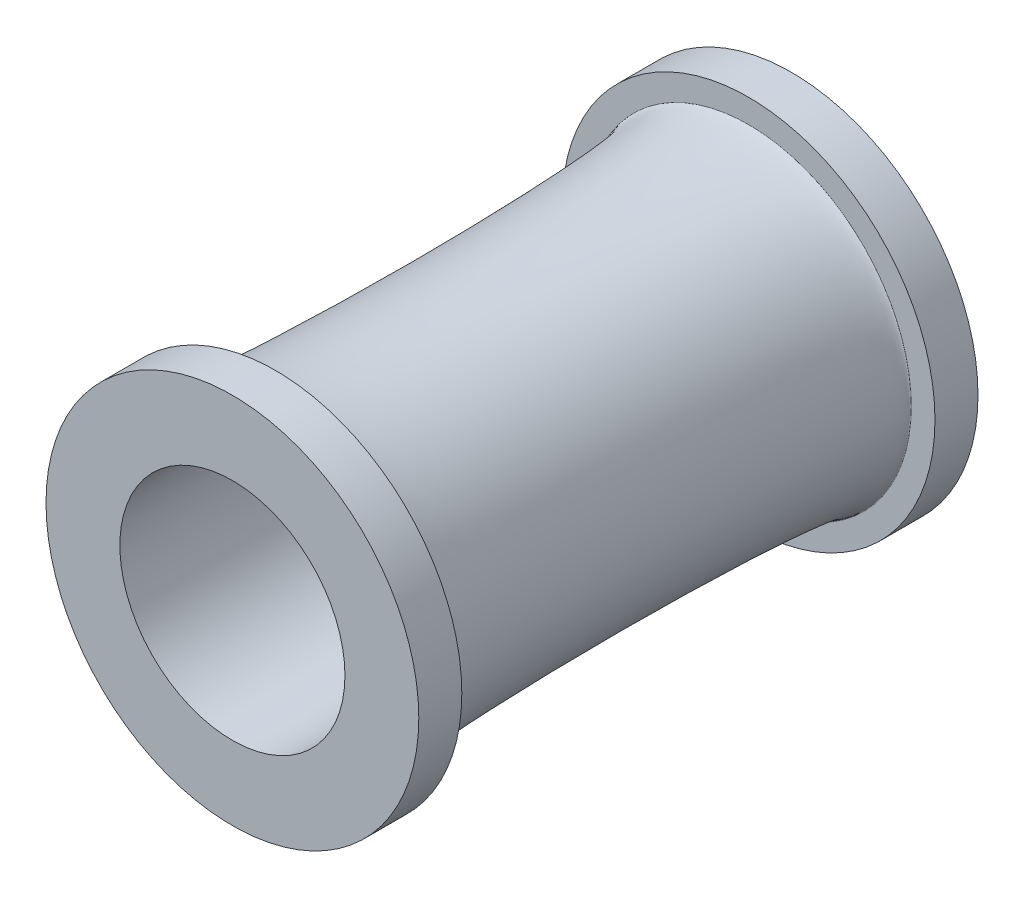
ISO-10303-21;
HEADER;
FILE_DESCRIPTION(('STEP AP214'),'2;1');
FILE_NAME('part.step','',(''),(''),'','','');
FILE_SCHEMA(('AUTOMOTIVE_DESIGN { 1 0 10303 214 1 1 1 1 }'));
ENDSEC;
DATA;
#1=APPLICATION_CONTEXT('core data for automotive mechanical design processes');
#2=APPLICATION_PROTOCOL_DEFINITION('international standard','automotive_design',2000,#1);
#3=PRODUCT_CONTEXT('',#1,'mechanical');
#4=PRODUCT('Part','Part','',(#3));
#5=PRODUCT_RELATED_PRODUCT_CATEGORY('part','',(#4));
#6=PRODUCT_DEFINITION_FORMATION('','',#4);
#7=PRODUCT_DEFINITION_CONTEXT('part definition',#1,'design');
#8=PRODUCT_DEFINITION('design','',#6,#7);
#9=PRODUCT_DEFINITION_SHAPE('','',#8);
#10=(LENGTH_UNIT() NAMED_UNIT(*) SI_UNIT(.MILLI.,.METRE.));
#11=(NAMED_UNIT(*) PLANE_ANGLE_UNIT() SI_UNIT($,.RADIAN.));
#12=(NAMED_UNIT(*) SI_UNIT($,.STERADIAN.) SOLID_ANGLE_UNIT());
#13=UNCERTAINTY_MEASURE_WITH_UNIT(LENGTH_MEASURE(1.E-05),#10,'distance_accuracy_value','');
#14=(GEOMETRIC_REPRESENTATION_CONTEXT(3) GLOBAL_UNCERTAINTY_ASSIGNED_CONTEXT((#13)) GLOBAL_UNIT_ASSIGNED_CONTEXT((#10,
#11,#12)) REPRESENTATION_CONTEXT('',''));
#15=CARTESIAN_POINT('',(0.,0.,0.));
#16=DIRECTION('',(0.,0.,1.));
#17=DIRECTION('',(1.,0.,0.));
#18=AXIS2_PLACEMENT_3D('',#15,#16,#17);
#19=CARTESIAN_POINT('',(0.,0.,41.91));
#20=DIRECTION('',(0.,0.,1.));
#21=DIRECTION('',(1.,0.,0.));
#22=AXIS2_PLACEMENT_3D('',#19,#20,#21);
#23=PLANE('',#22);
#24=CARTESIAN_POINT('',(0.,0.,41.91));
#25=DIRECTION('',(0.,0.,1.));
#26=DIRECTION('',(1.,0.,0.));
#27=AXIS2_PLACEMENT_3D('',#24,#25,#26);
#28=CIRCLE('',#27,14.4145);
#29=CARTESIAN_POINT('',(14.4145,0.,41.91));
#30=VERTEX_POINT('',#29);
#31=EDGE_CURVE('E45',#30,#30,#28,.T.);
#32=ORIENTED_EDGE('',*,*,#31,.T.);
#33=EDGE_LOOP('',(#32));
#34=FACE_BOUND('',#33,.T.);
#35=CARTESIAN_POINT('',(0.,0.,41.91));
#36=DIRECTION('',(0.,0.,1.));
#37=DIRECTION('',(1.,0.,0.));
#38=AXIS2_PLACEMENT_3D('',#35,#36,#37);
#39=CIRCLE('',#38,16.51);
#40=CARTESIAN_POINT('',(16.51,0.,41.91));
#41=VERTEX_POINT('',#40);
#42=EDGE_CURVE('E53',#41,#41,#39,.T.);
#43=ORIENTED_EDGE('',*,*,#42,.F.);
#44=EDGE_LOOP('',(#43));
#45=FACE_BOUND('',#44,.T.);
#46=ADVANCED_FACE('F33',(#34,#45),#23,.F.);
#47=CARTESIAN_POINT('',(-14.4145,0.,20.955));
#48=DIRECTION('',(0.,1.,0.));
#49=DIRECTION('',(0.,0.,1.));
#50=AXIS2_PLACEMENT_3D('',#47,#48,#49);
#51=ELLIPSE('',#50,20.955,1.13586222472773);
#52=CARTESIAN_POINT('',(0.,0.,45.72));
#53=DIRECTION('',(0.,0.,1.));
#54=AXIS1_PLACEMENT('',#52,#53);
#55=SURFACE_OF_REVOLUTION('',#51,#54);
#56=ORIENTED_EDGE('',*,*,#31,.F.);
#57=EDGE_LOOP('',(#56));
#58=FACE_BOUND('',#57,.T.);
#59=CARTESIAN_POINT('',(0.,0.,0.));
#60=DIRECTION('',(0.,0.,1.));
#61=DIRECTION('',(1.,0.,0.));
#62=AXIS2_PLACEMENT_3D('',#59,#60,#61);
#63=CIRCLE('',#62,14.4145);
#64=CARTESIAN_POINT('',(14.4145,0.,0.));
#65=VERTEX_POINT('',#64);
#66=EDGE_CURVE('E50',#65,#65,#63,.T.);
#67=ORIENTED_EDGE('',*,*,#66,.T.);
#68=EDGE_LOOP('',(#67));
#69=FACE_BOUND('',#68,.T.);
#70=ADVANCED_FACE('F58',(#58,#69),#55,.F.);
#71=CARTESIAN_POINT('',(0.,0.,0.));
#72=DIRECTION('',(0.,0.,-1.));
#73=DIRECTION('',(1.,0.,0.));
#74=AXIS2_PLACEMENT_3D('',#71,#72,#73);
#75=PLANE('',#74);
#76=ORIENTED_EDGE('',*,*,#66,.F.);
#77=EDGE_LOOP('',(#76));
#78=FACE_BOUND('',#77,.T.);
#79=CARTESIAN_POINT('',(0.,0.,0.));
#80=DIRECTION('',(0.,0.,-1.));
#81=DIRECTION('',(-1.,0.,0.));
#82=AXIS2_PLACEMENT_3D('',#79,#80,#81);
#83=CIRCLE('',#82,16.51);
#84=CARTESIAN_POINT('',(-16.51,0.,0.));
#85=VERTEX_POINT('',#84);
#86=EDGE_CURVE('E37',#85,#85,#83,.T.);
#87=ORIENTED_EDGE('',*,*,#86,.F.);
#88=EDGE_LOOP('',(#87));
#89=FACE_BOUND('',#88,.T.);
#90=ADVANCED_FACE('F62',(#78,#89),#75,.F.);
#91=CARTESIAN_POINT('',(0.,0.,45.72));
#92=DIRECTION('',(0.,0.,-1.));
#93=DIRECTION('',(-1.,0.,0.));
#94=AXIS2_PLACEMENT_3D('',#91,#92,#93);
#95=CYLINDRICAL_SURFACE('',#94,16.51);
#96=CARTESIAN_POINT('',(0.,0.,-3.81));
#97=DIRECTION('',(0.,0.,-1.));
#98=DIRECTION('',(-1.,0.,0.));
#99=AXIS2_PLACEMENT_3D('',#96,#97,#98);
#100=CIRCLE('',#99,16.51);
#101=CARTESIAN_POINT('',(-16.51,0.,-3.81));
#102=VERTEX_POINT('',#101);
#103=EDGE_CURVE('E91',#102,#102,#100,.T.);
#104=ORIENTED_EDGE('',*,*,#103,.F.);
#105=EDGE_LOOP('',(#104));
#106=FACE_BOUND('',#105,.T.);
#107=ORIENTED_EDGE('',*,*,#86,.T.);
#108=EDGE_LOOP('',(#107));
#109=FACE_BOUND('',#108,.T.);
#110=ADVANCED_FACE('F72',(#106,#109),#95,.T.);
#111=CARTESIAN_POINT('',(0.,0.,45.72));
#112=DIRECTION('',(0.,0.,1.));
#113=DIRECTION('',(1.,0.,0.));
#114=AXIS2_PLACEMENT_3D('',#111,#112,#113);
#115=PLANE('',#114);
#116=CARTESIAN_POINT('',(0.,0.,45.72));
#117=DIRECTION('',(0.,0.,1.));
#118=DIRECTION('',(1.,0.,0.));
#119=AXIS2_PLACEMENT_3D('',#116,#117,#118);
#120=CIRCLE('',#119,9.9695);
#121=CARTESIAN_POINT('',(9.9695,0.,45.72));
#122=VERTEX_POINT('',#121);
#123=EDGE_CURVE('E10',#122,#122,#120,.T.);
#124=ORIENTED_EDGE('',*,*,#123,.F.);
#125=EDGE_LOOP('',(#124));
#126=FACE_BOUND('',#125,.T.);
#127=CARTESIAN_POINT('',(0.,0.,45.72));
#128=DIRECTION('',(0.,0.,-1.));
#129=DIRECTION('',(-1.,0.,0.));
#130=AXIS2_PLACEMENT_3D('',#127,#128,#129);
#131=CIRCLE('',#130,16.51);
#132=CARTESIAN_POINT('',(-16.51,0.,45.72));
#133=VERTEX_POINT('',#132);
#134=EDGE_CURVE('E87',#133,#133,#131,.T.);
#135=ORIENTED_EDGE('',*,*,#134,.F.);
#136=EDGE_LOOP('',(#135));
#137=FACE_BOUND('',#136,.T.);
#138=ADVANCED_FACE('F68',(#126,#137),#115,.T.);
#139=CARTESIAN_POINT('',(0.,0.,-3.81));
#140=DIRECTION('',(0.,0.,-1.));
#141=DIRECTION('',(1.,0.,0.));
#142=AXIS2_PLACEMENT_3D('',#139,#140,#141);
#143=PLANE('',#142);
#144=CARTESIAN_POINT('',(0.,0.,-3.81));
#145=DIRECTION('',(0.,0.,1.));
#146=DIRECTION('',(1.,0.,0.));
#147=AXIS2_PLACEMENT_3D('',#144,#145,#146);
#148=CIRCLE('',#147,9.9695);
#149=CARTESIAN_POINT('',(9.9695,0.,-3.81));
#150=VERTEX_POINT('',#149);
#151=EDGE_CURVE('E41',#150,#150,#148,.T.);
#152=ORIENTED_EDGE('',*,*,#151,.T.);
#153=EDGE_LOOP('',(#152));
#154=FACE_BOUND('',#153,.T.);
#155=ORIENTED_EDGE('',*,*,#103,.T.);
#156=EDGE_LOOP('',(#155));
#157=FACE_BOUND('',#156,.T.);
#158=ADVANCED_FACE('F65',(#154,#157),#143,.T.);
#159=CARTESIAN_POINT('',(0.,0.,41.91));
#160=DIRECTION('',(0.,0.,-1.));
#161=DIRECTION('',(-1.,0.,0.));
#162=AXIS2_PLACEMENT_3D('',#159,#160,#161);
#163=CYLINDRICAL_SURFACE('',#162,9.9695);
#164=ORIENTED_EDGE('',*,*,#123,.T.);
#165=EDGE_LOOP('',(#164));
#166=FACE_BOUND('',#165,.T.);
#167=ORIENTED_EDGE('',*,*,#151,.F.);
#168=EDGE_LOOP('',(#167));
#169=FACE_BOUND('',#168,.T.);
#170=ADVANCED_FACE('F35',(#166,#169),#163,.F.);
#171=ORIENTED_EDGE('',*,*,#134,.T.);
#172=EDGE_LOOP('',(#171));
#173=FACE_BOUND('',#172,.T.);
#174=ORIENTED_EDGE('',*,*,#42,.T.);
#175=EDGE_LOOP('',(#174));
#176=FACE_BOUND('',#175,.T.);
#177=ADVANCED_FACE('F64',(#173,#176),#95,.T.);
#178=CLOSED_SHELL('',(#46,#70,#90,#110,#138,#158,#170,#177));
#179=MANIFOLD_SOLID_BREP('B2',#178);
#180=ADVANCED_BREP_SHAPE_REPRESENTATION('',(#18,#179),#14);
#181=SHAPE_DEFINITION_REPRESENTATION(#9,#180);
ENDSEC;
END-ISO-10303-21;
